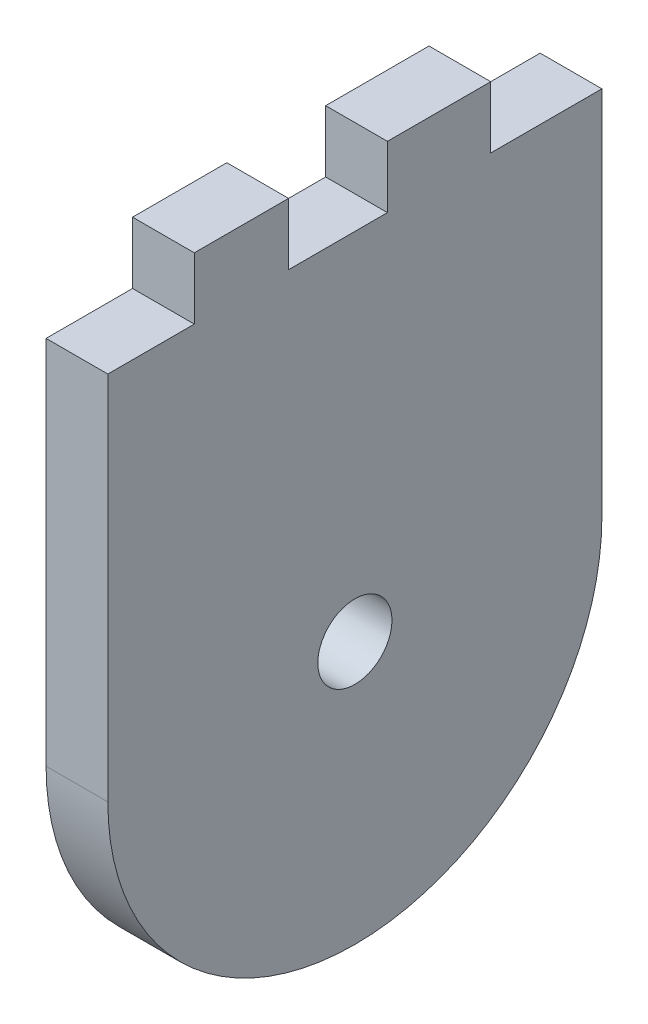
ISO-10303-21;
HEADER;
FILE_DESCRIPTION(('STEP AP214'),'2;1');
FILE_NAME('part.step','',(''),(''),'','','');
FILE_SCHEMA(('AUTOMOTIVE_DESIGN { 1 0 10303 214 1 1 1 1 }'));
ENDSEC;
DATA;
#1=APPLICATION_CONTEXT('core data for automotive mechanical design processes');
#2=APPLICATION_PROTOCOL_DEFINITION('international standard','automotive_design',2000,#1);
#3=PRODUCT_CONTEXT('',#1,'mechanical');
#4=PRODUCT('Part','Part','',(#3));
#5=PRODUCT_RELATED_PRODUCT_CATEGORY('part','',(#4));
#6=PRODUCT_DEFINITION_FORMATION('','',#4);
#7=PRODUCT_DEFINITION_CONTEXT('part definition',#1,'design');
#8=PRODUCT_DEFINITION('design','',#6,#7);
#9=PRODUCT_DEFINITION_SHAPE('','',#8);
#10=(LENGTH_UNIT() NAMED_UNIT(*) SI_UNIT(.MILLI.,.METRE.));
#11=(NAMED_UNIT(*) PLANE_ANGLE_UNIT() SI_UNIT($,.RADIAN.));
#12=(NAMED_UNIT(*) SI_UNIT($,.STERADIAN.) SOLID_ANGLE_UNIT());
#13=UNCERTAINTY_MEASURE_WITH_UNIT(LENGTH_MEASURE(1.E-05),#10,'distance_accuracy_value','');
#14=(GEOMETRIC_REPRESENTATION_CONTEXT(3) GLOBAL_UNCERTAINTY_ASSIGNED_CONTEXT((#13)) GLOBAL_UNIT_ASSIGNED_CONTEXT((#10,
#11,#12)) REPRESENTATION_CONTEXT('',''));
#15=CARTESIAN_POINT('',(0.,0.,0.));
#16=DIRECTION('',(0.,0.,1.));
#17=DIRECTION('',(1.,0.,0.));
#18=AXIS2_PLACEMENT_3D('',#15,#16,#17);
#19=CARTESIAN_POINT('',(-5.,55.,40.));
#20=DIRECTION('',(0.,-1.,0.));
#21=DIRECTION('',(0.,0.,-1.));
#22=AXIS2_PLACEMENT_3D('',#19,#20,#21);
#23=PLANE('',#22);
#24=DIRECTION('',(0.,0.,-1.));
#25=VECTOR('',#24,1.);
#26=CARTESIAN_POINT('',(-5.,55.,40.));
#27=LINE('',#26,#25);
#28=CARTESIAN_POINT('',(-5.,55.,33.));
#29=VERTEX_POINT('',#28);
#30=CARTESIAN_POINT('',(-5.,55.,25.3660375931076));
#31=VERTEX_POINT('',#30);
#32=EDGE_CURVE('E218',#29,#31,#27,.T.);
#33=ORIENTED_EDGE('',*,*,#32,.F.);
#34=DIRECTION('',(-1.,0.,0.));
#35=VECTOR('',#34,1.);
#36=CARTESIAN_POINT('',(0.,55.,33.));
#37=LINE('',#36,#35);
#38=CARTESIAN_POINT('',(0.,55.,33.));
#39=VERTEX_POINT('',#38);
#40=EDGE_CURVE('E190',#39,#29,#37,.T.);
#41=ORIENTED_EDGE('',*,*,#40,.F.);
#42=DIRECTION('',(0.,0.,-1.));
#43=VECTOR('',#42,1.);
#44=CARTESIAN_POINT('',(0.,55.,40.));
#45=LINE('',#44,#43);
#46=CARTESIAN_POINT('',(0.,55.,25.3660375931076));
#47=VERTEX_POINT('',#46);
#48=EDGE_CURVE('E221',#39,#47,#45,.T.);
#49=ORIENTED_EDGE('',*,*,#48,.T.);
#50=DIRECTION('',(-1.,0.,0.));
#51=VECTOR('',#50,1.);
#52=CARTESIAN_POINT('',(0.,55.,25.3660375931076));
#53=LINE('',#52,#51);
#54=EDGE_CURVE('E192',#47,#31,#53,.T.);
#55=ORIENTED_EDGE('',*,*,#54,.T.);
#56=EDGE_LOOP('',(#33,#41,#49,#55));
#57=FACE_BOUND('',#56,.T.);
#58=ADVANCED_FACE('F34',(#57),#23,.F.);
#59=CARTESIAN_POINT('',(0.,51.5,40.));
#60=DIRECTION('',(-1.,0.,0.));
#61=DIRECTION('',(0.,0.,1.));
#62=AXIS2_PLACEMENT_3D('',#59,#60,#61);
#63=PLANE('',#62);
#64=CARTESIAN_POINT('',(0.,21.2375980792143,20.));
#65=DIRECTION('',(-1.,0.,0.));
#66=DIRECTION('',(0.,0.,1.));
#67=AXIS2_PLACEMENT_3D('',#64,#65,#66);
#68=CIRCLE('',#67,3.);
#69=CARTESIAN_POINT('',(0.,21.2375980792143,23.));
#70=VERTEX_POINT('',#69);
#71=EDGE_CURVE('E204',#70,#70,#68,.T.);
#72=ORIENTED_EDGE('',*,*,#71,.T.);
#73=EDGE_LOOP('',(#72));
#74=FACE_BOUND('',#73,.T.);
#75=DIRECTION('',(0.,-1.,0.));
#76=VECTOR('',#75,1.);
#77=CARTESIAN_POINT('',(0.,55.,33.));
#78=LINE('',#77,#76);
#79=CARTESIAN_POINT('',(0.,50.,33.));
#80=VERTEX_POINT('',#79);
#81=EDGE_CURVE('E168',#39,#80,#78,.T.);
#82=ORIENTED_EDGE('',*,*,#81,.T.);
#83=DIRECTION('',(0.,0.,1.));
#84=VECTOR('',#83,1.);
#85=CARTESIAN_POINT('',(0.,50.,33.));
#86=LINE('',#85,#84);
#87=CARTESIAN_POINT('',(0.,50.,40.));
#88=VERTEX_POINT('',#87);
#89=EDGE_CURVE('E170',#80,#88,#86,.T.);
#90=ORIENTED_EDGE('',*,*,#89,.T.);
#91=DIRECTION('',(0.,1.,0.));
#92=VECTOR('',#91,1.);
#93=CARTESIAN_POINT('',(0.,0.,40.));
#94=LINE('',#93,#92);
#95=CARTESIAN_POINT('',(0.,20.,40.));
#96=VERTEX_POINT('',#95);
#97=EDGE_CURVE('E207',#96,#88,#94,.T.);
#98=ORIENTED_EDGE('',*,*,#97,.F.);
#99=CARTESIAN_POINT('',(0.,20.,20.));
#100=DIRECTION('',(-1.,0.,0.));
#101=DIRECTION('',(0.,0.,1.));
#102=AXIS2_PLACEMENT_3D('',#99,#100,#101);
#103=CIRCLE('',#102,20.);
#104=CARTESIAN_POINT('',(0.,0.,20.));
#105=VERTEX_POINT('',#104);
#106=EDGE_CURVE('E222',#96,#105,#103,.F.);
#107=ORIENTED_EDGE('',*,*,#106,.T.);
#108=CARTESIAN_POINT('',(0.,20.,20.));
#109=DIRECTION('',(-1.,0.,0.));
#110=DIRECTION('',(0.,0.,1.));
#111=AXIS2_PLACEMENT_3D('',#108,#109,#110);
#112=CIRCLE('',#111,20.);
#113=CARTESIAN_POINT('',(0.,20.,0.));
#114=VERTEX_POINT('',#113);
#115=EDGE_CURVE('E224',#105,#114,#112,.F.);
#116=ORIENTED_EDGE('',*,*,#115,.T.);
#117=DIRECTION('',(0.,1.,0.));
#118=VECTOR('',#117,1.);
#119=CARTESIAN_POINT('',(0.,51.5,0.));
#120=LINE('',#119,#118);
#121=CARTESIAN_POINT('',(0.,50.,0.));
#122=VERTEX_POINT('',#121);
#123=EDGE_CURVE('E155',#114,#122,#120,.T.);
#124=ORIENTED_EDGE('',*,*,#123,.T.);
#125=DIRECTION('',(0.,0.,1.));
#126=VECTOR('',#125,1.);
#127=CARTESIAN_POINT('',(0.,50.,0.));
#128=LINE('',#127,#126);
#129=CARTESIAN_POINT('',(0.,50.,9.00000000000001));
#130=VERTEX_POINT('',#129);
#131=EDGE_CURVE('E133',#122,#130,#128,.T.);
#132=ORIENTED_EDGE('',*,*,#131,.T.);
#133=DIRECTION('',(0.,1.,0.));
#134=VECTOR('',#133,1.);
#135=CARTESIAN_POINT('',(0.,50.,9.00000000000001));
#136=LINE('',#135,#134);
#137=CARTESIAN_POINT('',(0.,55.,9.));
#138=VERTEX_POINT('',#137);
#139=EDGE_CURVE('E143',#130,#138,#136,.T.);
#140=ORIENTED_EDGE('',*,*,#139,.T.);
#141=CARTESIAN_POINT('',(0.,55.,17.3660375931076));
#142=VERTEX_POINT('',#141);
#143=EDGE_CURVE('E219',#142,#138,#45,.T.);
#144=ORIENTED_EDGE('',*,*,#143,.F.);
#145=DIRECTION('',(0.,-1.,0.));
#146=VECTOR('',#145,1.);
#147=CARTESIAN_POINT('',(0.,55.,17.3660375931076));
#148=LINE('',#147,#146);
#149=CARTESIAN_POINT('',(0.,50.,17.3660375931076));
#150=VERTEX_POINT('',#149);
#151=EDGE_CURVE('E149',#142,#150,#148,.T.);
#152=ORIENTED_EDGE('',*,*,#151,.T.);
#153=DIRECTION('',(0.,0.,1.));
#154=VECTOR('',#153,1.);
#155=CARTESIAN_POINT('',(0.,50.,17.3660375931076));
#156=LINE('',#155,#154);
#157=CARTESIAN_POINT('',(0.,50.,25.3660375931076));
#158=VERTEX_POINT('',#157);
#159=EDGE_CURVE('E162',#150,#158,#156,.T.);
#160=ORIENTED_EDGE('',*,*,#159,.T.);
#161=DIRECTION('',(0.,1.,0.));
#162=VECTOR('',#161,1.);
#163=CARTESIAN_POINT('',(0.,50.,25.3660375931076));
#164=LINE('',#163,#162);
#165=EDGE_CURVE('E165',#158,#47,#164,.T.);
#166=ORIENTED_EDGE('',*,*,#165,.T.);
#167=ORIENTED_EDGE('',*,*,#48,.F.);
#168=EDGE_LOOP('',(#82,#90,#98,#107,#116,#124,#132,#140,#144,#152,#160,#166,#167));
#169=FACE_BOUND('',#168,.T.);
#170=ADVANCED_FACE('F153',(#74,#169),#63,.F.);
#171=CARTESIAN_POINT('',(-5.,55.,17.3660375931076));
#172=VERTEX_POINT('',#171);
#173=CARTESIAN_POINT('',(-5.,55.,9.));
#174=VERTEX_POINT('',#173);
#175=EDGE_CURVE('E213',#172,#174,#27,.T.);
#176=ORIENTED_EDGE('',*,*,#175,.F.);
#177=DIRECTION('',(-1.,0.,0.));
#178=VECTOR('',#177,1.);
#179=CARTESIAN_POINT('',(0.,55.,17.3660375931076));
#180=LINE('',#179,#178);
#181=EDGE_CURVE('E50',#142,#172,#180,.T.);
#182=ORIENTED_EDGE('',*,*,#181,.F.);
#183=ORIENTED_EDGE('',*,*,#143,.T.);
#184=DIRECTION('',(-1.,0.,0.));
#185=VECTOR('',#184,1.);
#186=CARTESIAN_POINT('',(0.,55.,9.));
#187=LINE('',#186,#185);
#188=EDGE_CURVE('E139',#138,#174,#187,.T.);
#189=ORIENTED_EDGE('',*,*,#188,.T.);
#190=EDGE_LOOP('',(#176,#182,#183,#189));
#191=FACE_BOUND('',#190,.T.);
#192=ADVANCED_FACE('F252',(#191),#23,.F.);
#193=CARTESIAN_POINT('',(-5.,0.,40.));
#194=DIRECTION('',(1.,0.,0.));
#195=DIRECTION('',(0.,0.,-1.));
#196=AXIS2_PLACEMENT_3D('',#193,#194,#195);
#197=PLANE('',#196);
#198=CARTESIAN_POINT('',(-5.,21.2375980792143,20.));
#199=DIRECTION('',(-1.,0.,0.));
#200=DIRECTION('',(0.,0.,1.));
#201=AXIS2_PLACEMENT_3D('',#198,#199,#200);
#202=CIRCLE('',#201,3.);
#203=CARTESIAN_POINT('',(-5.,21.2375980792143,23.));
#204=VERTEX_POINT('',#203);
#205=EDGE_CURVE('E187',#204,#204,#202,.T.);
#206=ORIENTED_EDGE('',*,*,#205,.F.);
#207=EDGE_LOOP('',(#206));
#208=FACE_BOUND('',#207,.T.);
#209=DIRECTION('',(0.,-1.,0.));
#210=VECTOR('',#209,1.);
#211=CARTESIAN_POINT('',(-5.,0.,40.));
#212=LINE('',#211,#210);
#213=CARTESIAN_POINT('',(-5.,50.,40.));
#214=VERTEX_POINT('',#213);
#215=CARTESIAN_POINT('',(-5.,20.,40.));
#216=VERTEX_POINT('',#215);
#217=EDGE_CURVE('E210',#214,#216,#212,.T.);
#218=ORIENTED_EDGE('',*,*,#217,.F.);
#219=DIRECTION('',(0.,0.,1.));
#220=VECTOR('',#219,1.);
#221=CARTESIAN_POINT('',(-5.,50.,33.));
#222=LINE('',#221,#220);
#223=CARTESIAN_POINT('',(-5.,50.,33.));
#224=VERTEX_POINT('',#223);
#225=EDGE_CURVE('E58',#224,#214,#222,.T.);
#226=ORIENTED_EDGE('',*,*,#225,.F.);
#227=DIRECTION('',(0.,-1.,0.));
#228=VECTOR('',#227,1.);
#229=CARTESIAN_POINT('',(-5.,55.,33.));
#230=LINE('',#229,#228);
#231=EDGE_CURVE('E157',#29,#224,#230,.T.);
#232=ORIENTED_EDGE('',*,*,#231,.F.);
#233=ORIENTED_EDGE('',*,*,#32,.T.);
#234=DIRECTION('',(0.,1.,0.));
#235=VECTOR('',#234,1.);
#236=CARTESIAN_POINT('',(-5.,50.,25.3660375931076));
#237=LINE('',#236,#235);
#238=CARTESIAN_POINT('',(-5.,50.,25.3660375931076));
#239=VERTEX_POINT('',#238);
#240=EDGE_CURVE('E181',#239,#31,#237,.T.);
#241=ORIENTED_EDGE('',*,*,#240,.F.);
#242=DIRECTION('',(0.,0.,1.));
#243=VECTOR('',#242,1.);
#244=CARTESIAN_POINT('',(-5.,50.,17.3660375931076));
#245=LINE('',#244,#243);
#246=CARTESIAN_POINT('',(-5.,50.,17.3660375931076));
#247=VERTEX_POINT('',#246);
#248=EDGE_CURVE('E178',#247,#239,#245,.T.);
#249=ORIENTED_EDGE('',*,*,#248,.F.);
#250=DIRECTION('',(0.,-1.,0.));
#251=VECTOR('',#250,1.);
#252=CARTESIAN_POINT('',(-5.,55.,17.3660375931076));
#253=LINE('',#252,#251);
#254=EDGE_CURVE('E176',#172,#247,#253,.T.);
#255=ORIENTED_EDGE('',*,*,#254,.F.);
#256=ORIENTED_EDGE('',*,*,#175,.T.);
#257=DIRECTION('',(0.,1.,0.));
#258=VECTOR('',#257,1.);
#259=CARTESIAN_POINT('',(-5.,50.,9.00000000000001));
#260=LINE('',#259,#258);
#261=CARTESIAN_POINT('',(-5.,50.,9.00000000000001));
#262=VERTEX_POINT('',#261);
#263=EDGE_CURVE('E174',#262,#174,#260,.T.);
#264=ORIENTED_EDGE('',*,*,#263,.F.);
#265=DIRECTION('',(0.,0.,1.));
#266=VECTOR('',#265,1.);
#267=CARTESIAN_POINT('',(-5.,50.,0.));
#268=LINE('',#267,#266);
#269=CARTESIAN_POINT('',(-5.,50.,0.));
#270=VERTEX_POINT('',#269);
#271=EDGE_CURVE('E136',#270,#262,#268,.T.);
#272=ORIENTED_EDGE('',*,*,#271,.F.);
#273=DIRECTION('',(0.,-1.,0.));
#274=VECTOR('',#273,1.);
#275=CARTESIAN_POINT('',(-5.,0.,0.));
#276=LINE('',#275,#274);
#277=CARTESIAN_POINT('',(-5.,20.,0.));
#278=VERTEX_POINT('',#277);
#279=EDGE_CURVE('E211',#270,#278,#276,.T.);
#280=ORIENTED_EDGE('',*,*,#279,.T.);
#281=CARTESIAN_POINT('',(-5.,20.,20.));
#282=DIRECTION('',(1.,0.,0.));
#283=DIRECTION('',(0.,0.,-1.));
#284=AXIS2_PLACEMENT_3D('',#281,#282,#283);
#285=CIRCLE('',#284,20.);
#286=CARTESIAN_POINT('',(-5.,0.,20.));
#287=VERTEX_POINT('',#286);
#288=EDGE_CURVE('E43',#278,#287,#285,.F.);
#289=ORIENTED_EDGE('',*,*,#288,.T.);
#290=CARTESIAN_POINT('',(-5.,20.,20.));
#291=DIRECTION('',(1.,0.,0.));
#292=DIRECTION('',(0.,0.,-1.));
#293=AXIS2_PLACEMENT_3D('',#290,#291,#292);
#294=CIRCLE('',#293,20.);
#295=EDGE_CURVE('E229',#287,#216,#294,.F.);
#296=ORIENTED_EDGE('',*,*,#295,.T.);
#297=EDGE_LOOP('',(#218,#226,#232,#233,#241,#249,#255,#256,#264,#272,#280,#289,#296));
#298=FACE_BOUND('',#297,.T.);
#299=ADVANCED_FACE('F236',(#208,#298),#197,.F.);
#300=CARTESIAN_POINT('',(0.,0.,40.));
#301=DIRECTION('',(0.,0.,-1.));
#302=DIRECTION('',(-1.,0.,0.));
#303=AXIS2_PLACEMENT_3D('',#300,#301,#302);
#304=PLANE('',#303);
#305=ORIENTED_EDGE('',*,*,#97,.T.);
#306=DIRECTION('',(-1.,0.,0.));
#307=VECTOR('',#306,1.);
#308=CARTESIAN_POINT('',(0.,50.,40.));
#309=LINE('',#308,#307);
#310=EDGE_CURVE('E185',#88,#214,#309,.T.);
#311=ORIENTED_EDGE('',*,*,#310,.T.);
#312=ORIENTED_EDGE('',*,*,#217,.T.);
#313=DIRECTION('',(1.,0.,0.));
#314=VECTOR('',#313,1.);
#315=CARTESIAN_POINT('',(0.,20.,40.));
#316=LINE('',#315,#314);
#317=EDGE_CURVE('E11',#216,#96,#316,.T.);
#318=ORIENTED_EDGE('',*,*,#317,.T.);
#319=EDGE_LOOP('',(#305,#311,#312,#318));
#320=FACE_BOUND('',#319,.T.);
#321=ADVANCED_FACE('F272',(#320),#304,.F.);
#322=CARTESIAN_POINT('',(0.,0.,0.));
#323=DIRECTION('',(0.,0.,-1.));
#324=DIRECTION('',(-1.,0.,0.));
#325=AXIS2_PLACEMENT_3D('',#322,#323,#324);
#326=PLANE('',#325);
#327=DIRECTION('',(-1.,0.,0.));
#328=VECTOR('',#327,1.);
#329=CARTESIAN_POINT('',(0.,50.,0.));
#330=LINE('',#329,#328);
#331=EDGE_CURVE('E140',#122,#270,#330,.T.);
#332=ORIENTED_EDGE('',*,*,#331,.F.);
#333=ORIENTED_EDGE('',*,*,#123,.F.);
#334=DIRECTION('',(1.,0.,0.));
#335=VECTOR('',#334,1.);
#336=CARTESIAN_POINT('',(-5.,20.,0.));
#337=LINE('',#336,#335);
#338=EDGE_CURVE('E226',#114,#278,#337,.F.);
#339=ORIENTED_EDGE('',*,*,#338,.T.);
#340=ORIENTED_EDGE('',*,*,#279,.F.);
#341=EDGE_LOOP('',(#332,#333,#339,#340));
#342=FACE_BOUND('',#341,.T.);
#343=ADVANCED_FACE('F249',(#342),#326,.T.);
#344=CARTESIAN_POINT('',(0.,20.,20.));
#345=DIRECTION('',(1.,0.,0.));
#346=DIRECTION('',(0.,1.,0.));
#347=AXIS2_PLACEMENT_3D('',#344,#345,#346);
#348=CYLINDRICAL_SURFACE('',#347,20.);
#349=ORIENTED_EDGE('',*,*,#317,.F.);
#350=ORIENTED_EDGE('',*,*,#295,.F.);
#351=DIRECTION('',(1.,0.,0.));
#352=VECTOR('',#351,1.);
#353=CARTESIAN_POINT('',(0.,0.,20.));
#354=LINE('',#353,#352);
#355=EDGE_CURVE('E38',#105,#287,#354,.F.);
#356=ORIENTED_EDGE('',*,*,#355,.F.);
#357=ORIENTED_EDGE('',*,*,#106,.F.);
#358=EDGE_LOOP('',(#349,#350,#356,#357));
#359=FACE_BOUND('',#358,.T.);
#360=ADVANCED_FACE('F36',(#359),#348,.T.);
#361=CARTESIAN_POINT('',(0.,20.,20.));
#362=DIRECTION('',(-1.,0.,0.));
#363=DIRECTION('',(0.,-1.,0.));
#364=AXIS2_PLACEMENT_3D('',#361,#362,#363);
#365=CYLINDRICAL_SURFACE('',#364,20.);
#366=ORIENTED_EDGE('',*,*,#288,.F.);
#367=ORIENTED_EDGE('',*,*,#338,.F.);
#368=ORIENTED_EDGE('',*,*,#115,.F.);
#369=ORIENTED_EDGE('',*,*,#355,.T.);
#370=EDGE_LOOP('',(#366,#367,#368,#369));
#371=FACE_BOUND('',#370,.T.);
#372=ADVANCED_FACE('F246',(#371),#365,.T.);
#373=CARTESIAN_POINT('',(5.,21.2375980792143,20.));
#374=DIRECTION('',(-1.,0.,0.));
#375=DIRECTION('',(0.,0.,1.));
#376=AXIS2_PLACEMENT_3D('',#373,#374,#375);
#377=CYLINDRICAL_SURFACE('',#376,3.);
#378=ORIENTED_EDGE('',*,*,#205,.T.);
#379=EDGE_LOOP('',(#378));
#380=FACE_BOUND('',#379,.T.);
#381=ORIENTED_EDGE('',*,*,#71,.F.);
#382=EDGE_LOOP('',(#381));
#383=FACE_BOUND('',#382,.T.);
#384=ADVANCED_FACE('F304',(#380,#383),#377,.F.);
#385=CARTESIAN_POINT('',(0.,50.,0.));
#386=DIRECTION('',(0.,-1.,0.));
#387=DIRECTION('',(0.,0.,-1.));
#388=AXIS2_PLACEMENT_3D('',#385,#386,#387);
#389=PLANE('',#388);
#390=ORIENTED_EDGE('',*,*,#271,.T.);
#391=DIRECTION('',(-1.,0.,0.));
#392=VECTOR('',#391,1.);
#393=CARTESIAN_POINT('',(0.,50.,9.00000000000001));
#394=LINE('',#393,#392);
#395=EDGE_CURVE('E129',#130,#262,#394,.T.);
#396=ORIENTED_EDGE('',*,*,#395,.F.);
#397=ORIENTED_EDGE('',*,*,#131,.F.);
#398=ORIENTED_EDGE('',*,*,#331,.T.);
#399=EDGE_LOOP('',(#390,#396,#397,#398));
#400=FACE_BOUND('',#399,.T.);
#401=ADVANCED_FACE('F131',(#400),#389,.F.);
#402=CARTESIAN_POINT('',(0.,50.,9.00000000000001));
#403=DIRECTION('',(0.,0.,1.));
#404=DIRECTION('',(0.,-1.,0.));
#405=AXIS2_PLACEMENT_3D('',#402,#403,#404);
#406=PLANE('',#405);
#407=ORIENTED_EDGE('',*,*,#263,.T.);
#408=ORIENTED_EDGE('',*,*,#188,.F.);
#409=ORIENTED_EDGE('',*,*,#139,.F.);
#410=ORIENTED_EDGE('',*,*,#395,.T.);
#411=EDGE_LOOP('',(#407,#408,#409,#410));
#412=FACE_BOUND('',#411,.T.);
#413=ADVANCED_FACE('F144',(#412),#406,.F.);
#414=CARTESIAN_POINT('',(0.,50.,33.));
#415=DIRECTION('',(0.,-1.,0.));
#416=DIRECTION('',(0.,0.,-1.));
#417=AXIS2_PLACEMENT_3D('',#414,#415,#416);
#418=PLANE('',#417);
#419=ORIENTED_EDGE('',*,*,#225,.T.);
#420=ORIENTED_EDGE('',*,*,#310,.F.);
#421=ORIENTED_EDGE('',*,*,#89,.F.);
#422=DIRECTION('',(-1.,0.,0.));
#423=VECTOR('',#422,1.);
#424=CARTESIAN_POINT('',(0.,50.,33.));
#425=LINE('',#424,#423);
#426=EDGE_CURVE('E188',#80,#224,#425,.T.);
#427=ORIENTED_EDGE('',*,*,#426,.T.);
#428=EDGE_LOOP('',(#419,#420,#421,#427));
#429=FACE_BOUND('',#428,.T.);
#430=ADVANCED_FACE('F274',(#429),#418,.F.);
#431=CARTESIAN_POINT('',(0.,55.,33.));
#432=DIRECTION('',(0.,0.,-1.));
#433=DIRECTION('',(-1.,0.,0.));
#434=AXIS2_PLACEMENT_3D('',#431,#432,#433);
#435=PLANE('',#434);
#436=ORIENTED_EDGE('',*,*,#231,.T.);
#437=ORIENTED_EDGE('',*,*,#426,.F.);
#438=ORIENTED_EDGE('',*,*,#81,.F.);
#439=ORIENTED_EDGE('',*,*,#40,.T.);
#440=EDGE_LOOP('',(#436,#437,#438,#439));
#441=FACE_BOUND('',#440,.T.);
#442=ADVANCED_FACE('F270',(#441),#435,.F.);
#443=CARTESIAN_POINT('',(0.,50.,25.3660375931076));
#444=DIRECTION('',(0.,0.,1.));
#445=DIRECTION('',(1.,0.,0.));
#446=AXIS2_PLACEMENT_3D('',#443,#444,#445);
#447=PLANE('',#446);
#448=ORIENTED_EDGE('',*,*,#240,.T.);
#449=ORIENTED_EDGE('',*,*,#54,.F.);
#450=ORIENTED_EDGE('',*,*,#165,.F.);
#451=DIRECTION('',(-1.,0.,0.));
#452=VECTOR('',#451,1.);
#453=CARTESIAN_POINT('',(0.,50.,25.3660375931076));
#454=LINE('',#453,#452);
#455=EDGE_CURVE('E195',#158,#239,#454,.T.);
#456=ORIENTED_EDGE('',*,*,#455,.T.);
#457=EDGE_LOOP('',(#448,#449,#450,#456));
#458=FACE_BOUND('',#457,.T.);
#459=ADVANCED_FACE('F261',(#458),#447,.F.);
#460=CARTESIAN_POINT('',(0.,50.,17.3660375931076));
#461=DIRECTION('',(0.,-1.,0.));
#462=DIRECTION('',(0.,0.,-1.));
#463=AXIS2_PLACEMENT_3D('',#460,#461,#462);
#464=PLANE('',#463);
#465=ORIENTED_EDGE('',*,*,#248,.T.);
#466=ORIENTED_EDGE('',*,*,#455,.F.);
#467=ORIENTED_EDGE('',*,*,#159,.F.);
#468=DIRECTION('',(-1.,0.,0.));
#469=VECTOR('',#468,1.);
#470=CARTESIAN_POINT('',(0.,50.,17.3660375931076));
#471=LINE('',#470,#469);
#472=EDGE_CURVE('E197',#150,#247,#471,.T.);
#473=ORIENTED_EDGE('',*,*,#472,.T.);
#474=EDGE_LOOP('',(#465,#466,#467,#473));
#475=FACE_BOUND('',#474,.T.);
#476=ADVANCED_FACE('F257',(#475),#464,.F.);
#477=CARTESIAN_POINT('',(0.,55.,17.3660375931076));
#478=DIRECTION('',(0.,0.,-1.));
#479=DIRECTION('',(-1.,0.,0.));
#480=AXIS2_PLACEMENT_3D('',#477,#478,#479);
#481=PLANE('',#480);
#482=ORIENTED_EDGE('',*,*,#254,.T.);
#483=ORIENTED_EDGE('',*,*,#472,.F.);
#484=ORIENTED_EDGE('',*,*,#151,.F.);
#485=ORIENTED_EDGE('',*,*,#181,.T.);
#486=EDGE_LOOP('',(#482,#483,#484,#485));
#487=FACE_BOUND('',#486,.T.);
#488=ADVANCED_FACE('F254',(#487),#481,.F.);
#489=CLOSED_SHELL('',(#58,#170,#192,#299,#321,#343,#360,#372,#384,#401,#413,#430,#442,#459,#476,#488));
#490=MANIFOLD_SOLID_BREP('B2',#489);
#491=ADVANCED_BREP_SHAPE_REPRESENTATION('',(#18,#490),#14);
#492=SHAPE_DEFINITION_REPRESENTATION(#9,#491);
ENDSEC;
END-ISO-10303-21;
